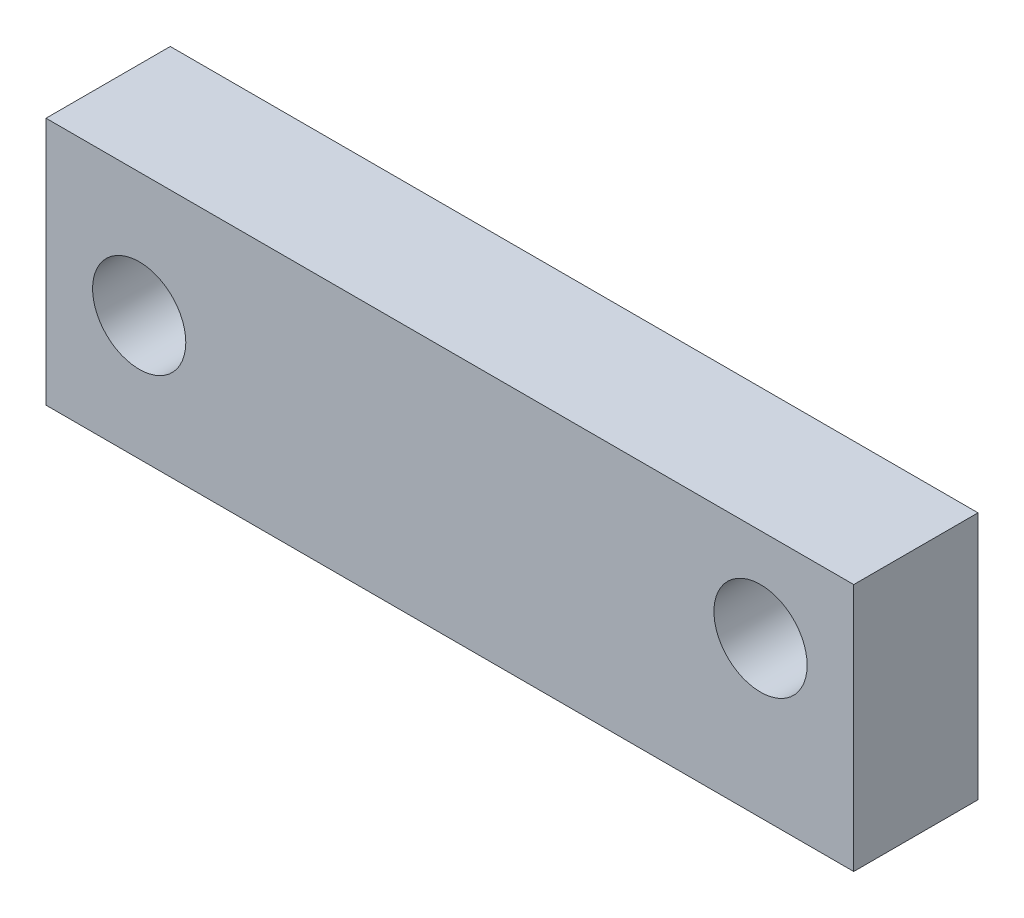
ISO-10303-21;
HEADER;
FILE_DESCRIPTION(('STEP AP214'),'2;1');
FILE_NAME('part.step','',(''),(''),'','','');
FILE_SCHEMA(('AUTOMOTIVE_DESIGN { 1 0 10303 214 1 1 1 1 }'));
ENDSEC;
DATA;
#1=APPLICATION_CONTEXT('core data for automotive mechanical design processes');
#2=APPLICATION_PROTOCOL_DEFINITION('international standard','automotive_design',2000,#1);
#3=PRODUCT_CONTEXT('',#1,'mechanical');
#4=PRODUCT('Part','Part','',(#3));
#5=PRODUCT_RELATED_PRODUCT_CATEGORY('part','',(#4));
#6=PRODUCT_DEFINITION_FORMATION('','',#4);
#7=PRODUCT_DEFINITION_CONTEXT('part definition',#1,'design');
#8=PRODUCT_DEFINITION('design','',#6,#7);
#9=PRODUCT_DEFINITION_SHAPE('','',#8);
#10=(LENGTH_UNIT() NAMED_UNIT(*) SI_UNIT(.MILLI.,.METRE.));
#11=(NAMED_UNIT(*) PLANE_ANGLE_UNIT() SI_UNIT($,.RADIAN.));
#12=(NAMED_UNIT(*) SI_UNIT($,.STERADIAN.) SOLID_ANGLE_UNIT());
#13=UNCERTAINTY_MEASURE_WITH_UNIT(LENGTH_MEASURE(1.E-05),#10,'distance_accuracy_value','');
#14=(GEOMETRIC_REPRESENTATION_CONTEXT(3) GLOBAL_UNCERTAINTY_ASSIGNED_CONTEXT((#13)) GLOBAL_UNIT_ASSIGNED_CONTEXT((#10,
#11,#12)) REPRESENTATION_CONTEXT('',''));
#15=CARTESIAN_POINT('',(0.,0.,0.));
#16=DIRECTION('',(0.,0.,1.));
#17=DIRECTION('',(1.,0.,0.));
#18=AXIS2_PLACEMENT_3D('',#15,#16,#17);
#19=CARTESIAN_POINT('',(-71.,-56.,90.2));
#20=DIRECTION('',(0.,0.,-1.));
#21=DIRECTION('',(-1.,0.,0.));
#22=AXIS2_PLACEMENT_3D('',#19,#20,#21);
#23=PLANE('',#22);
#24=CARTESIAN_POINT('',(-48.,-51.,90.2));
#25=DIRECTION('',(0.,0.,-1.));
#26=DIRECTION('',(-1.,0.,0.));
#27=AXIS2_PLACEMENT_3D('',#24,#25,#26);
#28=CIRCLE('',#27,1.5);
#29=CARTESIAN_POINT('',(-49.5,-51.,90.2));
#30=VERTEX_POINT('',#29);
#31=EDGE_CURVE('E37',#30,#30,#28,.T.);
#32=ORIENTED_EDGE('',*,*,#31,.F.);
#33=EDGE_LOOP('',(#32));
#34=FACE_BOUND('',#33,.T.);
#35=CARTESIAN_POINT('',(-68.,-52.,90.2));
#36=DIRECTION('',(0.,0.,-1.));
#37=DIRECTION('',(-1.,0.,0.));
#38=AXIS2_PLACEMENT_3D('',#35,#36,#37);
#39=CIRCLE('',#38,1.5);
#40=CARTESIAN_POINT('',(-69.5,-52.,90.2));
#41=VERTEX_POINT('',#40);
#42=EDGE_CURVE('E109',#41,#41,#39,.T.);
#43=ORIENTED_EDGE('',*,*,#42,.F.);
#44=EDGE_LOOP('',(#43));
#45=FACE_BOUND('',#44,.T.);
#46=DIRECTION('',(1.,0.,0.));
#47=VECTOR('',#46,1.);
#48=CARTESIAN_POINT('',(-71.,-48.,90.2));
#49=LINE('',#48,#47);
#50=CARTESIAN_POINT('',(-71.,-48.,90.2));
#51=VERTEX_POINT('',#50);
#52=CARTESIAN_POINT('',(-45.,-48.,90.2));
#53=VERTEX_POINT('',#52);
#54=EDGE_CURVE('E42',#51,#53,#49,.T.);
#55=ORIENTED_EDGE('',*,*,#54,.T.);
#56=DIRECTION('',(0.,1.,0.));
#57=VECTOR('',#56,1.);
#58=CARTESIAN_POINT('',(-45.,-56.,90.2));
#59=LINE('',#58,#57);
#60=CARTESIAN_POINT('',(-45.,-56.,90.2));
#61=VERTEX_POINT('',#60);
#62=EDGE_CURVE('E75',#61,#53,#59,.T.);
#63=ORIENTED_EDGE('',*,*,#62,.F.);
#64=DIRECTION('',(1.,0.,0.));
#65=VECTOR('',#64,1.);
#66=CARTESIAN_POINT('',(-71.,-56.,90.2));
#67=LINE('',#66,#65);
#68=CARTESIAN_POINT('',(-71.,-56.,90.2));
#69=VERTEX_POINT('',#68);
#70=EDGE_CURVE('E80',#69,#61,#67,.T.);
#71=ORIENTED_EDGE('',*,*,#70,.F.);
#72=DIRECTION('',(0.,1.,0.));
#73=VECTOR('',#72,1.);
#74=CARTESIAN_POINT('',(-71.,-56.,90.2));
#75=LINE('',#74,#73);
#76=EDGE_CURVE('E78',#69,#51,#75,.T.);
#77=ORIENTED_EDGE('',*,*,#76,.T.);
#78=EDGE_LOOP('',(#55,#63,#71,#77));
#79=FACE_BOUND('',#78,.T.);
#80=ADVANCED_FACE('F33',(#34,#45,#79),#23,.T.);
#81=CARTESIAN_POINT('',(-71.,-48.,94.2));
#82=DIRECTION('',(0.,1.,0.));
#83=DIRECTION('',(0.,0.,1.));
#84=AXIS2_PLACEMENT_3D('',#81,#82,#83);
#85=PLANE('',#84);
#86=DIRECTION('',(1.,0.,0.));
#87=VECTOR('',#86,1.);
#88=CARTESIAN_POINT('',(-71.,-48.,94.2));
#89=LINE('',#88,#87);
#90=CARTESIAN_POINT('',(-71.,-48.,94.2));
#91=VERTEX_POINT('',#90);
#92=CARTESIAN_POINT('',(-45.,-48.,94.2));
#93=VERTEX_POINT('',#92);
#94=EDGE_CURVE('E11',#91,#93,#89,.T.);
#95=ORIENTED_EDGE('',*,*,#94,.T.);
#96=DIRECTION('',(0.,0.,1.));
#97=VECTOR('',#96,1.);
#98=CARTESIAN_POINT('',(-45.,-48.,94.2));
#99=LINE('',#98,#97);
#100=EDGE_CURVE('E83',#53,#93,#99,.T.);
#101=ORIENTED_EDGE('',*,*,#100,.F.);
#102=ORIENTED_EDGE('',*,*,#54,.F.);
#103=DIRECTION('',(0.,0.,1.));
#104=VECTOR('',#103,1.);
#105=CARTESIAN_POINT('',(-71.,-48.,94.2));
#106=LINE('',#105,#104);
#107=EDGE_CURVE('E105',#51,#91,#106,.T.);
#108=ORIENTED_EDGE('',*,*,#107,.T.);
#109=EDGE_LOOP('',(#95,#101,#102,#108));
#110=FACE_BOUND('',#109,.T.);
#111=ADVANCED_FACE('F84',(#110),#85,.T.);
#112=CARTESIAN_POINT('',(-71.,0.,0.));
#113=DIRECTION('',(-1.,0.,0.));
#114=DIRECTION('',(0.,0.,1.));
#115=AXIS2_PLACEMENT_3D('',#112,#113,#114);
#116=PLANE('',#115);
#117=DIRECTION('',(0.,-1.,0.));
#118=VECTOR('',#117,1.);
#119=CARTESIAN_POINT('',(-71.,-56.,94.2));
#120=LINE('',#119,#118);
#121=CARTESIAN_POINT('',(-71.,-56.,94.2));
#122=VERTEX_POINT('',#121);
#123=EDGE_CURVE('E92',#91,#122,#120,.T.);
#124=ORIENTED_EDGE('',*,*,#123,.F.);
#125=ORIENTED_EDGE('',*,*,#107,.F.);
#126=ORIENTED_EDGE('',*,*,#76,.F.);
#127=DIRECTION('',(0.,0.,-1.));
#128=VECTOR('',#127,1.);
#129=CARTESIAN_POINT('',(-71.,-56.,94.2));
#130=LINE('',#129,#128);
#131=EDGE_CURVE('E94',#122,#69,#130,.T.);
#132=ORIENTED_EDGE('',*,*,#131,.F.);
#133=EDGE_LOOP('',(#124,#125,#126,#132));
#134=FACE_BOUND('',#133,.T.);
#135=ADVANCED_FACE('F125',(#134),#116,.T.);
#136=CARTESIAN_POINT('',(-71.,-56.,94.2));
#137=DIRECTION('',(0.,0.,1.));
#138=DIRECTION('',(1.,0.,0.));
#139=AXIS2_PLACEMENT_3D('',#136,#137,#138);
#140=PLANE('',#139);
#141=CARTESIAN_POINT('',(-48.,-51.,94.2));
#142=DIRECTION('',(0.,0.,1.));
#143=DIRECTION('',(1.,0.,0.));
#144=AXIS2_PLACEMENT_3D('',#141,#142,#143);
#145=CIRCLE('',#144,1.5);
#146=CARTESIAN_POINT('',(-46.5,-51.,94.2));
#147=VERTEX_POINT('',#146);
#148=EDGE_CURVE('E111',#147,#147,#145,.T.);
#149=ORIENTED_EDGE('',*,*,#148,.F.);
#150=EDGE_LOOP('',(#149));
#151=FACE_BOUND('',#150,.T.);
#152=CARTESIAN_POINT('',(-68.,-52.,94.2));
#153=DIRECTION('',(0.,0.,1.));
#154=DIRECTION('',(1.,0.,0.));
#155=AXIS2_PLACEMENT_3D('',#152,#153,#154);
#156=CIRCLE('',#155,1.5);
#157=CARTESIAN_POINT('',(-66.5,-52.,94.2));
#158=VERTEX_POINT('',#157);
#159=EDGE_CURVE('E98',#158,#158,#156,.T.);
#160=ORIENTED_EDGE('',*,*,#159,.F.);
#161=EDGE_LOOP('',(#160));
#162=FACE_BOUND('',#161,.T.);
#163=DIRECTION('',(1.,0.,0.));
#164=VECTOR('',#163,1.);
#165=CARTESIAN_POINT('',(-71.,-56.,94.2));
#166=LINE('',#165,#164);
#167=CARTESIAN_POINT('',(-45.,-56.,94.2));
#168=VERTEX_POINT('',#167);
#169=EDGE_CURVE('E106',#122,#168,#166,.T.);
#170=ORIENTED_EDGE('',*,*,#169,.T.);
#171=DIRECTION('',(0.,-1.,0.));
#172=VECTOR('',#171,1.);
#173=CARTESIAN_POINT('',(-45.,-56.,94.2));
#174=LINE('',#173,#172);
#175=EDGE_CURVE('E87',#93,#168,#174,.T.);
#176=ORIENTED_EDGE('',*,*,#175,.F.);
#177=ORIENTED_EDGE('',*,*,#94,.F.);
#178=ORIENTED_EDGE('',*,*,#123,.T.);
#179=EDGE_LOOP('',(#170,#176,#177,#178));
#180=FACE_BOUND('',#179,.T.);
#181=ADVANCED_FACE('F35',(#151,#162,#180),#140,.T.);
#182=CARTESIAN_POINT('',(-48.,-51.,74.2));
#183=DIRECTION('',(0.,0.,1.));
#184=DIRECTION('',(1.,0.,0.));
#185=AXIS2_PLACEMENT_3D('',#182,#183,#184);
#186=CYLINDRICAL_SURFACE('',#185,1.5);
#187=ORIENTED_EDGE('',*,*,#31,.T.);
#188=EDGE_LOOP('',(#187));
#189=FACE_BOUND('',#188,.T.);
#190=ORIENTED_EDGE('',*,*,#148,.T.);
#191=EDGE_LOOP('',(#190));
#192=FACE_BOUND('',#191,.T.);
#193=ADVANCED_FACE('F124',(#189,#192),#186,.F.);
#194=CARTESIAN_POINT('',(-68.,-52.,74.2));
#195=DIRECTION('',(0.,0.,1.));
#196=DIRECTION('',(1.,0.,0.));
#197=AXIS2_PLACEMENT_3D('',#194,#195,#196);
#198=CYLINDRICAL_SURFACE('',#197,1.5);
#199=ORIENTED_EDGE('',*,*,#42,.T.);
#200=EDGE_LOOP('',(#199));
#201=FACE_BOUND('',#200,.T.);
#202=ORIENTED_EDGE('',*,*,#159,.T.);
#203=EDGE_LOOP('',(#202));
#204=FACE_BOUND('',#203,.T.);
#205=ADVANCED_FACE('F121',(#201,#204),#198,.F.);
#206=CARTESIAN_POINT('',(-71.,-56.,94.2));
#207=DIRECTION('',(0.,-1.,0.));
#208=DIRECTION('',(0.,0.,-1.));
#209=AXIS2_PLACEMENT_3D('',#206,#207,#208);
#210=PLANE('',#209);
#211=ORIENTED_EDGE('',*,*,#70,.T.);
#212=DIRECTION('',(0.,0.,-1.));
#213=VECTOR('',#212,1.);
#214=CARTESIAN_POINT('',(-45.,-56.,94.2));
#215=LINE('',#214,#213);
#216=EDGE_CURVE('E91',#168,#61,#215,.T.);
#217=ORIENTED_EDGE('',*,*,#216,.F.);
#218=ORIENTED_EDGE('',*,*,#169,.F.);
#219=ORIENTED_EDGE('',*,*,#131,.T.);
#220=EDGE_LOOP('',(#211,#217,#218,#219));
#221=FACE_BOUND('',#220,.T.);
#222=ADVANCED_FACE('F129',(#221),#210,.T.);
#223=CARTESIAN_POINT('',(-45.,40.,80.2));
#224=DIRECTION('',(1.,0.,0.));
#225=DIRECTION('',(0.,0.,-1.));
#226=AXIS2_PLACEMENT_3D('',#223,#224,#225);
#227=PLANE('',#226);
#228=ORIENTED_EDGE('',*,*,#100,.T.);
#229=ORIENTED_EDGE('',*,*,#175,.T.);
#230=ORIENTED_EDGE('',*,*,#216,.T.);
#231=ORIENTED_EDGE('',*,*,#62,.T.);
#232=EDGE_LOOP('',(#228,#229,#230,#231));
#233=FACE_BOUND('',#232,.T.);
#234=ADVANCED_FACE('F89',(#233),#227,.T.);
#235=CLOSED_SHELL('',(#80,#111,#135,#181,#193,#205,#222,#234));
#236=MANIFOLD_SOLID_BREP('B2',#235);
#237=ADVANCED_BREP_SHAPE_REPRESENTATION('',(#18,#236),#14);
#238=SHAPE_DEFINITION_REPRESENTATION(#9,#237);
ENDSEC;
END-ISO-10303-21;
